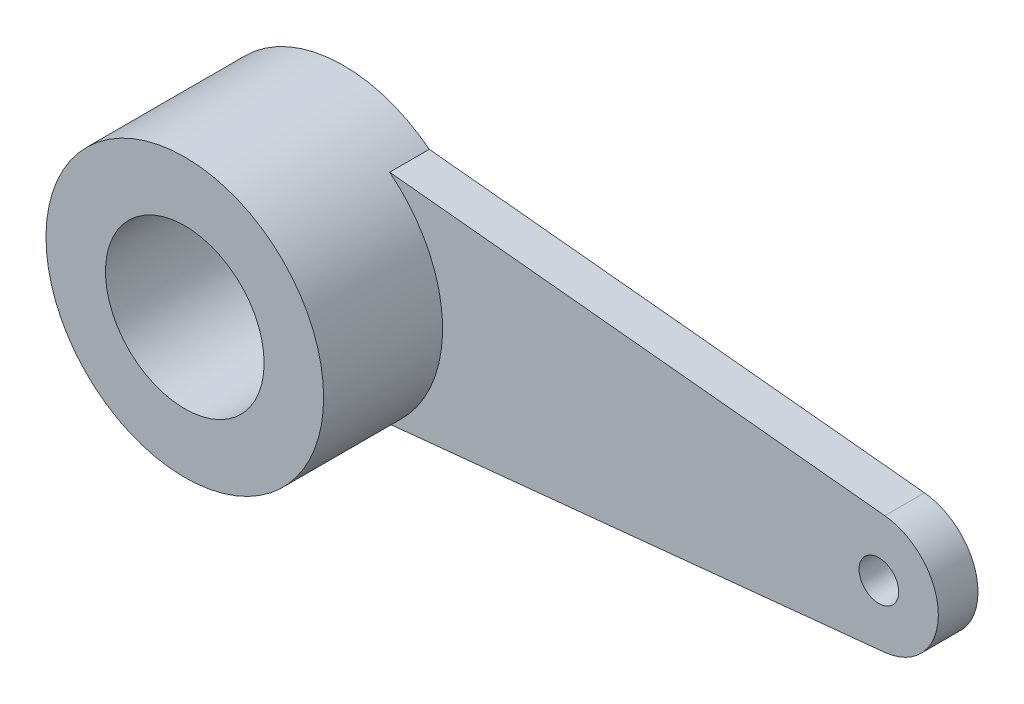
ISO-10303-21;
HEADER;
FILE_DESCRIPTION(('STEP AP214'),'2;1');
FILE_NAME('part.step','',(''),(''),'','','');
FILE_SCHEMA(('AUTOMOTIVE_DESIGN { 1 0 10303 214 1 1 1 1 }'));
ENDSEC;
DATA;
#1=APPLICATION_CONTEXT('core data for automotive mechanical design processes');
#2=APPLICATION_PROTOCOL_DEFINITION('international standard','automotive_design',2000,#1);
#3=PRODUCT_CONTEXT('',#1,'mechanical');
#4=PRODUCT('Part','Part','',(#3));
#5=PRODUCT_RELATED_PRODUCT_CATEGORY('part','',(#4));
#6=PRODUCT_DEFINITION_FORMATION('','',#4);
#7=PRODUCT_DEFINITION_CONTEXT('part definition',#1,'design');
#8=PRODUCT_DEFINITION('design','',#6,#7);
#9=PRODUCT_DEFINITION_SHAPE('','',#8);
#10=(LENGTH_UNIT() NAMED_UNIT(*) SI_UNIT(.MILLI.,.METRE.));
#11=(NAMED_UNIT(*) PLANE_ANGLE_UNIT() SI_UNIT($,.RADIAN.));
#12=(NAMED_UNIT(*) SI_UNIT($,.STERADIAN.) SOLID_ANGLE_UNIT());
#13=UNCERTAINTY_MEASURE_WITH_UNIT(LENGTH_MEASURE(1.E-05),#10,'distance_accuracy_value','');
#14=(GEOMETRIC_REPRESENTATION_CONTEXT(3) GLOBAL_UNCERTAINTY_ASSIGNED_CONTEXT((#13)) GLOBAL_UNIT_ASSIGNED_CONTEXT((#10,
#11,#12)) REPRESENTATION_CONTEXT('',''));
#15=CARTESIAN_POINT('',(0.,0.,0.));
#16=DIRECTION('',(0.,0.,1.));
#17=DIRECTION('',(1.,0.,0.));
#18=AXIS2_PLACEMENT_3D('',#15,#16,#17);
#19=CARTESIAN_POINT('',(0.295950270276392,-2.93826247582225,1.));
#20=DIRECTION('',(-0.100215817025014,0.994965723036733,0.));
#21=DIRECTION('',(-0.994965723036733,-0.100215817025014,0.));
#22=AXIS2_PLACEMENT_3D('',#19,#20,#21);
#23=PLANE('',#22);
#24=DIRECTION('',(0.994965723036733,0.100215817025014,0.));
#25=VECTOR('',#24,1.);
#26=CARTESIAN_POINT('',(0.295950270276392,-2.93826247582225,0.));
#27=LINE('',#26,#25);
#28=CARTESIAN_POINT('',(2.1650635094611,-2.75,0.));
#29=VERTEX_POINT('',#28);
#30=CARTESIAN_POINT('',(14.6503237255375,-1.4924485845551,0.));
#31=VERTEX_POINT('',#30);
#32=EDGE_CURVE('E112',#29,#31,#27,.T.);
#33=ORIENTED_EDGE('',*,*,#32,.T.);
#34=DIRECTION('',(0.,0.,-1.));
#35=VECTOR('',#34,1.);
#36=CARTESIAN_POINT('',(14.6503237255375,-1.4924485845551,1.));
#37=LINE('',#36,#35);
#38=CARTESIAN_POINT('',(14.6503237255375,-1.4924485845551,1.));
#39=VERTEX_POINT('',#38);
#40=EDGE_CURVE('E39',#39,#31,#37,.T.);
#41=ORIENTED_EDGE('',*,*,#40,.F.);
#42=DIRECTION('',(0.994965723036733,0.100215817025014,0.));
#43=VECTOR('',#42,1.);
#44=CARTESIAN_POINT('',(0.295950270276392,-2.93826247582225,1.));
#45=LINE('',#44,#43);
#46=CARTESIAN_POINT('',(2.1650635094611,-2.75,1.));
#47=VERTEX_POINT('',#46);
#48=EDGE_CURVE('E101',#47,#39,#45,.T.);
#49=ORIENTED_EDGE('',*,*,#48,.F.);
#50=DIRECTION('',(0.,0.,-1.));
#51=VECTOR('',#50,1.);
#52=CARTESIAN_POINT('',(2.1650635094611,-2.75,1.));
#53=LINE('',#52,#51);
#54=EDGE_CURVE('E91',#47,#29,#53,.T.);
#55=ORIENTED_EDGE('',*,*,#54,.T.);
#56=EDGE_LOOP('',(#33,#41,#49,#55));
#57=FACE_BOUND('',#56,.T.);
#58=ADVANCED_FACE('F36',(#57),#23,.F.);
#59=CARTESIAN_POINT('',(14.5,0.,1.));
#60=DIRECTION('',(0.,0.,-1.));
#61=DIRECTION('',(-1.,0.,0.));
#62=AXIS2_PLACEMENT_3D('',#59,#60,#61);
#63=CYLINDRICAL_SURFACE('',#62,1.5);
#64=CARTESIAN_POINT('',(14.5,0.,0.));
#65=DIRECTION('',(0.,0.,1.));
#66=DIRECTION('',(1.,0.,0.));
#67=AXIS2_PLACEMENT_3D('',#64,#65,#66);
#68=CIRCLE('',#67,1.5);
#69=CARTESIAN_POINT('',(14.6503237255375,1.4924485845551,0.));
#70=VERTEX_POINT('',#69);
#71=EDGE_CURVE('E114',#31,#70,#68,.T.);
#72=ORIENTED_EDGE('',*,*,#71,.T.);
#73=DIRECTION('',(0.,0.,-1.));
#74=VECTOR('',#73,1.);
#75=CARTESIAN_POINT('',(14.6503237255375,1.4924485845551,1.));
#76=LINE('',#75,#74);
#77=CARTESIAN_POINT('',(14.6503237255375,1.4924485845551,1.));
#78=VERTEX_POINT('',#77);
#79=EDGE_CURVE('E90',#78,#70,#76,.T.);
#80=ORIENTED_EDGE('',*,*,#79,.F.);
#81=CARTESIAN_POINT('',(14.5,0.,1.));
#82=DIRECTION('',(0.,0.,1.));
#83=DIRECTION('',(1.,0.,0.));
#84=AXIS2_PLACEMENT_3D('',#81,#82,#83);
#85=CIRCLE('',#84,1.5);
#86=EDGE_CURVE('E77',#39,#78,#85,.T.);
#87=ORIENTED_EDGE('',*,*,#86,.F.);
#88=ORIENTED_EDGE('',*,*,#40,.T.);
#89=EDGE_LOOP('',(#72,#80,#87,#88));
#90=FACE_BOUND('',#89,.T.);
#91=ADVANCED_FACE('F121',(#90),#63,.T.);
#92=CARTESIAN_POINT('',(0.295950270276392,2.93826247582225,1.));
#93=DIRECTION('',(0.100215817025014,0.994965723036733,0.));
#94=DIRECTION('',(-0.994965723036733,0.100215817025014,0.));
#95=AXIS2_PLACEMENT_3D('',#92,#93,#94);
#96=PLANE('',#95);
#97=DIRECTION('',(0.994965723036733,-0.100215817025014,0.));
#98=VECTOR('',#97,1.);
#99=CARTESIAN_POINT('',(0.295950270276392,2.93826247582225,0.));
#100=LINE('',#99,#98);
#101=CARTESIAN_POINT('',(2.1650635094611,2.75,0.));
#102=VERTEX_POINT('',#101);
#103=EDGE_CURVE('E89',#102,#70,#100,.T.);
#104=ORIENTED_EDGE('',*,*,#103,.F.);
#105=DIRECTION('',(0.,0.,-1.));
#106=VECTOR('',#105,1.);
#107=CARTESIAN_POINT('',(2.1650635094611,2.75,1.));
#108=LINE('',#107,#106);
#109=CARTESIAN_POINT('',(2.1650635094611,2.75,1.));
#110=VERTEX_POINT('',#109);
#111=EDGE_CURVE('E69',#110,#102,#108,.T.);
#112=ORIENTED_EDGE('',*,*,#111,.F.);
#113=DIRECTION('',(0.994965723036733,-0.100215817025014,0.));
#114=VECTOR('',#113,1.);
#115=CARTESIAN_POINT('',(0.295950270276392,2.93826247582225,1.));
#116=LINE('',#115,#114);
#117=EDGE_CURVE('E80',#110,#78,#116,.T.);
#118=ORIENTED_EDGE('',*,*,#117,.T.);
#119=ORIENTED_EDGE('',*,*,#79,.T.);
#120=EDGE_LOOP('',(#104,#112,#118,#119));
#121=FACE_BOUND('',#120,.T.);
#122=ADVANCED_FACE('F87',(#121),#96,.T.);
#123=CARTESIAN_POINT('',(0.,0.,1.));
#124=DIRECTION('',(0.,0.,-1.));
#125=DIRECTION('',(-1.,0.,0.));
#126=AXIS2_PLACEMENT_3D('',#123,#124,#125);
#127=CYLINDRICAL_SURFACE('',#126,2.);
#128=CARTESIAN_POINT('',(0.,0.,0.));
#129=DIRECTION('',(0.,0.,1.));
#130=DIRECTION('',(1.,0.,0.));
#131=AXIS2_PLACEMENT_3D('',#128,#129,#130);
#132=CIRCLE('',#131,2.);
#133=CARTESIAN_POINT('',(2.,0.,0.));
#134=VERTEX_POINT('',#133);
#135=EDGE_CURVE('E106',#134,#134,#132,.T.);
#136=ORIENTED_EDGE('',*,*,#135,.F.);
#137=EDGE_LOOP('',(#136));
#138=FACE_BOUND('',#137,.T.);
#139=CARTESIAN_POINT('',(0.,0.,4.));
#140=DIRECTION('',(0.,0.,1.));
#141=DIRECTION('',(1.,0.,0.));
#142=AXIS2_PLACEMENT_3D('',#139,#140,#141);
#143=CIRCLE('',#142,2.);
#144=CARTESIAN_POINT('',(2.,0.,4.));
#145=VERTEX_POINT('',#144);
#146=EDGE_CURVE('E159',#145,#145,#143,.T.);
#147=ORIENTED_EDGE('',*,*,#146,.T.);
#148=EDGE_LOOP('',(#147));
#149=FACE_BOUND('',#148,.T.);
#150=ADVANCED_FACE('F141',(#138,#149),#127,.F.);
#151=CARTESIAN_POINT('',(0.,0.,1.));
#152=DIRECTION('',(0.,0.,-1.));
#153=DIRECTION('',(-1.,0.,0.));
#154=AXIS2_PLACEMENT_3D('',#151,#152,#153);
#155=CYLINDRICAL_SURFACE('',#154,3.5);
#156=CARTESIAN_POINT('',(0.,0.,0.));
#157=DIRECTION('',(0.,0.,1.));
#158=DIRECTION('',(1.,0.,0.));
#159=AXIS2_PLACEMENT_3D('',#156,#157,#158);
#160=CIRCLE('',#159,3.5);
#161=EDGE_CURVE('E71',#102,#29,#160,.T.);
#162=ORIENTED_EDGE('',*,*,#161,.T.);
#163=ORIENTED_EDGE('',*,*,#54,.F.);
#164=CARTESIAN_POINT('',(0.,0.,1.));
#165=DIRECTION('',(0.,0.,1.));
#166=DIRECTION('',(1.,0.,0.));
#167=AXIS2_PLACEMENT_3D('',#164,#165,#166);
#168=CIRCLE('',#167,3.5);
#169=EDGE_CURVE('E11',#47,#110,#168,.T.);
#170=ORIENTED_EDGE('',*,*,#169,.T.);
#171=ORIENTED_EDGE('',*,*,#111,.T.);
#172=EDGE_LOOP('',(#162,#163,#170,#171));
#173=FACE_BOUND('',#172,.T.);
#174=CARTESIAN_POINT('',(0.,0.,4.));
#175=DIRECTION('',(0.,0.,1.));
#176=DIRECTION('',(1.,0.,0.));
#177=AXIS2_PLACEMENT_3D('',#174,#175,#176);
#178=CIRCLE('',#177,3.5);
#179=CARTESIAN_POINT('',(3.5,0.,4.));
#180=VERTEX_POINT('',#179);
#181=EDGE_CURVE('E115',#180,#180,#178,.T.);
#182=ORIENTED_EDGE('',*,*,#181,.F.);
#183=EDGE_LOOP('',(#182));
#184=FACE_BOUND('',#183,.T.);
#185=ADVANCED_FACE('F93',(#173,#184),#155,.T.);
#186=CARTESIAN_POINT('',(14.5,0.,1.));
#187=DIRECTION('',(0.,0.,-1.));
#188=DIRECTION('',(-1.,0.,0.));
#189=AXIS2_PLACEMENT_3D('',#186,#187,#188);
#190=CYLINDRICAL_SURFACE('',#189,0.500000000000001);
#191=CARTESIAN_POINT('',(14.5,0.,1.));
#192=DIRECTION('',(0.,0.,1.));
#193=DIRECTION('',(1.,0.,0.));
#194=AXIS2_PLACEMENT_3D('',#191,#192,#193);
#195=CIRCLE('',#194,0.500000000000001);
#196=CARTESIAN_POINT('',(15.,0.,1.));
#197=VERTEX_POINT('',#196);
#198=EDGE_CURVE('E84',#197,#197,#195,.T.);
#199=ORIENTED_EDGE('',*,*,#198,.T.);
#200=EDGE_LOOP('',(#199));
#201=FACE_BOUND('',#200,.T.);
#202=CARTESIAN_POINT('',(14.5,0.,0.));
#203=DIRECTION('',(0.,0.,1.));
#204=DIRECTION('',(1.,0.,0.));
#205=AXIS2_PLACEMENT_3D('',#202,#203,#204);
#206=CIRCLE('',#205,0.500000000000001);
#207=CARTESIAN_POINT('',(15.,0.,0.));
#208=VERTEX_POINT('',#207);
#209=EDGE_CURVE('E102',#208,#208,#206,.T.);
#210=ORIENTED_EDGE('',*,*,#209,.F.);
#211=EDGE_LOOP('',(#210));
#212=FACE_BOUND('',#211,.T.);
#213=ADVANCED_FACE('F132',(#201,#212),#190,.F.);
#214=CARTESIAN_POINT('',(0.,0.,1.));
#215=DIRECTION('',(0.,0.,1.));
#216=DIRECTION('',(1.,0.,0.));
#217=AXIS2_PLACEMENT_3D('',#214,#215,#216);
#218=PLANE('',#217);
#219=ORIENTED_EDGE('',*,*,#169,.F.);
#220=ORIENTED_EDGE('',*,*,#48,.T.);
#221=ORIENTED_EDGE('',*,*,#86,.T.);
#222=ORIENTED_EDGE('',*,*,#117,.F.);
#223=EDGE_LOOP('',(#219,#220,#221,#222));
#224=FACE_BOUND('',#223,.T.);
#225=ORIENTED_EDGE('',*,*,#198,.F.);
#226=EDGE_LOOP('',(#225));
#227=FACE_BOUND('',#226,.T.);
#228=ADVANCED_FACE('F81',(#224,#227),#218,.T.);
#229=CARTESIAN_POINT('',(0.,0.,0.));
#230=DIRECTION('',(0.,0.,1.));
#231=DIRECTION('',(1.,0.,0.));
#232=AXIS2_PLACEMENT_3D('',#229,#230,#231);
#233=PLANE('',#232);
#234=ORIENTED_EDGE('',*,*,#32,.F.);
#235=ORIENTED_EDGE('',*,*,#161,.F.);
#236=ORIENTED_EDGE('',*,*,#103,.T.);
#237=ORIENTED_EDGE('',*,*,#71,.F.);
#238=EDGE_LOOP('',(#234,#235,#236,#237));
#239=FACE_BOUND('',#238,.T.);
#240=ORIENTED_EDGE('',*,*,#135,.T.);
#241=EDGE_LOOP('',(#240));
#242=FACE_BOUND('',#241,.T.);
#243=ORIENTED_EDGE('',*,*,#209,.T.);
#244=EDGE_LOOP('',(#243));
#245=FACE_BOUND('',#244,.T.);
#246=ADVANCED_FACE('F123',(#239,#242,#245),#233,.F.);
#247=CARTESIAN_POINT('',(0.,0.,4.));
#248=DIRECTION('',(0.,0.,1.));
#249=DIRECTION('',(1.,0.,0.));
#250=AXIS2_PLACEMENT_3D('',#247,#248,#249);
#251=PLANE('',#250);
#252=ORIENTED_EDGE('',*,*,#181,.T.);
#253=EDGE_LOOP('',(#252));
#254=FACE_BOUND('',#253,.T.);
#255=ORIENTED_EDGE('',*,*,#146,.F.);
#256=EDGE_LOOP('',(#255));
#257=FACE_BOUND('',#256,.T.);
#258=ADVANCED_FACE('F126',(#254,#257),#251,.T.);
#259=CLOSED_SHELL('',(#58,#91,#122,#150,#185,#213,#228,#246,#258));
#260=MANIFOLD_SOLID_BREP('B2',#259);
#261=ADVANCED_BREP_SHAPE_REPRESENTATION('',(#18,#260),#14);
#262=SHAPE_DEFINITION_REPRESENTATION(#9,#261);
ENDSEC;
END-ISO-10303-21;
